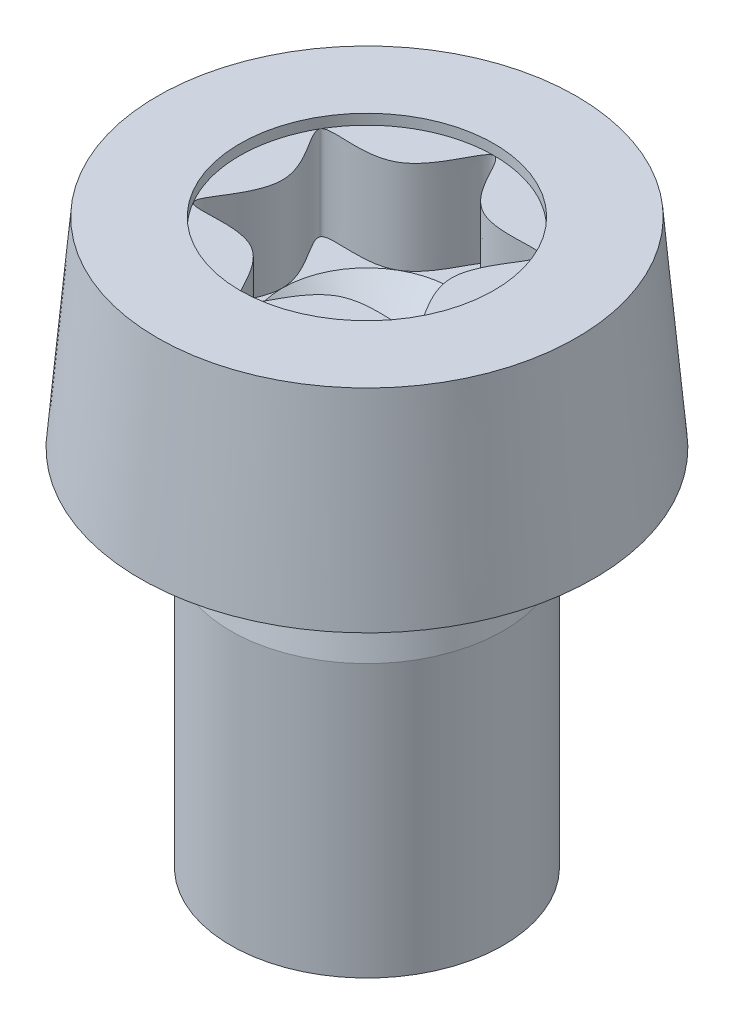
ISO-10303-21;
HEADER;
FILE_DESCRIPTION(('STEP AP214'),'2;1');
FILE_NAME('part.step','',(''),(''),'','','');
FILE_SCHEMA(('AUTOMOTIVE_DESIGN { 1 0 10303 214 1 1 1 1 }'));
ENDSEC;
DATA;
#1=APPLICATION_CONTEXT('core data for automotive mechanical design processes');
#2=APPLICATION_PROTOCOL_DEFINITION('international standard','automotive_design',2000,#1);
#3=PRODUCT_CONTEXT('',#1,'mechanical');
#4=PRODUCT('Part','Part','',(#3));
#5=PRODUCT_RELATED_PRODUCT_CATEGORY('part','',(#4));
#6=PRODUCT_DEFINITION_FORMATION('','',#4);
#7=PRODUCT_DEFINITION_CONTEXT('part definition',#1,'design');
#8=PRODUCT_DEFINITION('design','',#6,#7);
#9=PRODUCT_DEFINITION_SHAPE('','',#8);
#10=(LENGTH_UNIT() NAMED_UNIT(*) SI_UNIT(.MILLI.,.METRE.));
#11=(NAMED_UNIT(*) PLANE_ANGLE_UNIT() SI_UNIT($,.RADIAN.));
#12=(NAMED_UNIT(*) SI_UNIT($,.STERADIAN.) SOLID_ANGLE_UNIT());
#13=UNCERTAINTY_MEASURE_WITH_UNIT(LENGTH_MEASURE(1.E-05),#10,'distance_accuracy_value','');
#14=(GEOMETRIC_REPRESENTATION_CONTEXT(3) GLOBAL_UNCERTAINTY_ASSIGNED_CONTEXT((#13)) GLOBAL_UNIT_ASSIGNED_CONTEXT((#10,
#11,#12)) REPRESENTATION_CONTEXT('',''));
#15=CARTESIAN_POINT('',(0.,0.,0.));
#16=DIRECTION('',(0.,0.,1.));
#17=DIRECTION('',(1.,0.,0.));
#18=AXIS2_PLACEMENT_3D('',#15,#16,#17);
#19=CARTESIAN_POINT('',(0.,10.11,2.8));
#20=DIRECTION('',(0.,1.,0.));
#21=DIRECTION('',(0.,0.,1.));
#22=AXIS2_PLACEMENT_3D('',#19,#20,#21);
#23=PLANE('',#22);
#24=CARTESIAN_POINT('',(0.,10.11,-2.8));
#25=CARTESIAN_POINT('',(0.20130187734414,10.11,-2.8));
#26=CARTESIAN_POINT('',(0.603905632032412,10.11,-1.04599523765715));
#27=CARTESIAN_POINT('',(3.18437747187033,10.11,-1.83850119058572));
#28=CARTESIAN_POINT('',(1.20781126406484,10.11,0.));
#29=CARTESIAN_POINT('',(3.18437747187033,10.11,1.83850119058571));
#30=CARTESIAN_POINT('',(0.603905632032424,10.11,1.04599523765716));
#31=CARTESIAN_POINT('',(0.,10.11,3.67700238117141));
#32=CARTESIAN_POINT('',(-0.603905632032438,10.11,1.04599523765718));
#33=CARTESIAN_POINT('',(-3.18437747187032,10.11,1.83850119058571));
#34=CARTESIAN_POINT('',(-1.20781126406483,10.11,0.));
#35=CARTESIAN_POINT('',(-3.18437747187032,10.11,-1.83850119058571));
#36=CARTESIAN_POINT('',(-0.603905632032435,10.11,-1.04599523765716));
#37=CARTESIAN_POINT('',(-0.201301877344143,10.11,-2.80000000000001));
#38=CARTESIAN_POINT('',(0.,10.11,-2.8));
#39=B_SPLINE_CURVE_WITH_KNOTS('',3,(#24,#25,#26,#27,#28,#29,#30,#31,#32,#33,#34,#35,#36,#37,
#38),.UNSPECIFIED.,.T.,.F.,(4,1,1,1,1,1,1,1,1,1,1,1,4),(0.,0.0833333333333329,0.166666666666667,
0.25,0.333333333333334,0.416666666666668,0.5,0.583333333333333,0.666666666666667,0.75,
0.833333333333334,0.916666666666666,1.),.UNSPECIFIED.);
#40=CARTESIAN_POINT('',(0.933333333333329,10.11,-1.61658075373095));
#41=VERTEX_POINT('',#40);
#42=CARTESIAN_POINT('',(1.8666666666665,10.11,0.));
#43=VERTEX_POINT('',#42);
#44=EDGE_CURVE('E144',#41,#43,#39,.T.);
#45=ORIENTED_EDGE('',*,*,#44,.F.);
#46=CARTESIAN_POINT('',(0.,10.11,0.));
#47=DIRECTION('',(0.,-1.,0.));
#48=DIRECTION('',(0.,0.,-1.));
#49=AXIS2_PLACEMENT_3D('',#46,#47,#48);
#50=CIRCLE('',#49,1.8666666666665);
#51=EDGE_CURVE('E55',#41,#43,#50,.T.);
#52=ORIENTED_EDGE('',*,*,#51,.T.);
#53=EDGE_LOOP('',(#45,#52));
#54=FACE_BOUND('',#53,.T.);
#55=ADVANCED_FACE('F42',(#54),#23,.T.);
#56=CARTESIAN_POINT('',(0.933333333333247,10.11,1.61658075373081));
#57=VERTEX_POINT('',#56);
#58=EDGE_CURVE('E159',#43,#57,#39,.T.);
#59=ORIENTED_EDGE('',*,*,#58,.F.);
#60=EDGE_CURVE('E11',#43,#57,#50,.T.);
#61=ORIENTED_EDGE('',*,*,#60,.T.);
#62=EDGE_LOOP('',(#59,#61));
#63=FACE_BOUND('',#62,.T.);
#64=ADVANCED_FACE('F112',(#63),#23,.T.);
#65=CARTESIAN_POINT('',(-0.93333333333325,10.11,1.61658075373081));
#66=VERTEX_POINT('',#65);
#67=EDGE_CURVE('E152',#57,#66,#39,.T.);
#68=ORIENTED_EDGE('',*,*,#67,.F.);
#69=EDGE_CURVE('E53',#57,#66,#50,.T.);
#70=ORIENTED_EDGE('',*,*,#69,.T.);
#71=EDGE_LOOP('',(#68,#70));
#72=FACE_BOUND('',#71,.T.);
#73=ADVANCED_FACE('F119',(#72),#23,.T.);
#74=CARTESIAN_POINT('',(-1.8666666666665,10.11,0.));
#75=VERTEX_POINT('',#74);
#76=EDGE_CURVE('E150',#66,#75,#39,.T.);
#77=ORIENTED_EDGE('',*,*,#76,.F.);
#78=EDGE_CURVE('E437',#66,#75,#50,.T.);
#79=ORIENTED_EDGE('',*,*,#78,.T.);
#80=EDGE_LOOP('',(#77,#79));
#81=FACE_BOUND('',#80,.T.);
#82=ADVANCED_FACE('F133',(#81),#23,.T.);
#83=CARTESIAN_POINT('',(-0.933333333333257,10.11,-1.6165807537308));
#84=VERTEX_POINT('',#83);
#85=EDGE_CURVE('E141',#75,#84,#39,.T.);
#86=ORIENTED_EDGE('',*,*,#85,.F.);
#87=EDGE_CURVE('E214',#75,#84,#50,.T.);
#88=ORIENTED_EDGE('',*,*,#87,.T.);
#89=EDGE_LOOP('',(#86,#88));
#90=FACE_BOUND('',#89,.T.);
#91=ADVANCED_FACE('F125',(#90),#23,.T.);
#92=EDGE_CURVE('E137',#84,#41,#39,.T.);
#93=ORIENTED_EDGE('',*,*,#92,.F.);
#94=EDGE_CURVE('E139',#84,#41,#50,.T.);
#95=ORIENTED_EDGE('',*,*,#94,.T.);
#96=EDGE_LOOP('',(#93,#95));
#97=FACE_BOUND('',#96,.T.);
#98=ADVANCED_FACE('F115',(#97),#23,.T.);
#99=CARTESIAN_POINT('',(0.,12.4,0.));
#100=DIRECTION('',(0.,1.,0.));
#101=DIRECTION('',(0.,0.,1.));
#102=AXIS2_PLACEMENT_3D('',#99,#100,#101);
#103=PLANE('',#102);
#104=CARTESIAN_POINT('',(0.,12.4,0.));
#105=DIRECTION('',(0.,1.,0.));
#106=DIRECTION('',(0.,0.,1.));
#107=AXIS2_PLACEMENT_3D('',#104,#105,#106);
#108=CIRCLE('',#107,2.8);
#109=CARTESIAN_POINT('',(0.,12.4,2.8));
#110=VERTEX_POINT('',#109);
#111=EDGE_CURVE('E160',#110,#110,#108,.T.);
#112=ORIENTED_EDGE('',*,*,#111,.F.);
#113=EDGE_LOOP('',(#112));
#114=FACE_BOUND('',#113,.T.);
#115=CARTESIAN_POINT('',(0.,12.4,0.));
#116=DIRECTION('',(0.,-1.,0.));
#117=DIRECTION('',(0.,0.,-1.));
#118=AXIS2_PLACEMENT_3D('',#115,#116,#117);
#119=CIRCLE('',#118,4.61504988048596);
#120=CARTESIAN_POINT('',(0.,12.4,-4.61504988048596));
#121=VERTEX_POINT('',#120);
#122=EDGE_CURVE('E190',#121,#121,#119,.T.);
#123=ORIENTED_EDGE('',*,*,#122,.F.);
#124=EDGE_LOOP('',(#123));
#125=FACE_BOUND('',#124,.T.);
#126=ADVANCED_FACE('F124',(#114,#125),#103,.T.);
#127=CARTESIAN_POINT('',(0.,8.,0.));
#128=DIRECTION('',(0.,-1.,0.));
#129=DIRECTION('',(0.,0.,-1.));
#130=AXIS2_PLACEMENT_3D('',#127,#128,#129);
#131=CONICAL_SURFACE('',#130,5.,0.08726646259971);
#132=ORIENTED_EDGE('',*,*,#122,.T.);
#133=EDGE_LOOP('',(#132));
#134=FACE_BOUND('',#133,.T.);
#135=CARTESIAN_POINT('',(0.,8.,0.));
#136=DIRECTION('',(0.,-1.,0.));
#137=DIRECTION('',(0.,0.,-1.));
#138=AXIS2_PLACEMENT_3D('',#135,#136,#137);
#139=CIRCLE('',#138,5.);
#140=CARTESIAN_POINT('',(0.,8.,-5.));
#141=VERTEX_POINT('',#140);
#142=EDGE_CURVE('E193',#141,#141,#139,.T.);
#143=ORIENTED_EDGE('',*,*,#142,.F.);
#144=EDGE_LOOP('',(#143));
#145=FACE_BOUND('',#144,.T.);
#146=ADVANCED_FACE('F131',(#134,#145),#131,.T.);
#147=CARTESIAN_POINT('',(2.6,8.,0.));
#148=DIRECTION('',(0.,-1.,0.));
#149=DIRECTION('',(0.,0.,-1.));
#150=AXIS2_PLACEMENT_3D('',#147,#148,#149);
#151=PLANE('',#150);
#152=CARTESIAN_POINT('',(0.,8.,0.));
#153=DIRECTION('',(0.,-1.,0.));
#154=DIRECTION('',(0.,0.,-1.));
#155=AXIS2_PLACEMENT_3D('',#152,#153,#154);
#156=CIRCLE('',#155,2.90495097567964);
#157=CARTESIAN_POINT('',(0.,8.,-2.90495097567964));
#158=VERTEX_POINT('',#157);
#159=EDGE_CURVE('E202',#158,#158,#156,.F.);
#160=ORIENTED_EDGE('',*,*,#159,.T.);
#161=EDGE_LOOP('',(#160));
#162=FACE_BOUND('',#161,.T.);
#163=ORIENTED_EDGE('',*,*,#142,.T.);
#164=EDGE_LOOP('',(#163));
#165=FACE_BOUND('',#164,.T.);
#166=ADVANCED_FACE('F178',(#162,#165),#151,.T.);
#167=CARTESIAN_POINT('',(0.,6.,0.));
#168=DIRECTION('',(0.,-1.,0.));
#169=DIRECTION('',(0.,0.,-1.));
#170=AXIS2_PLACEMENT_3D('',#167,#168,#169);
#171=CONICAL_SURFACE('',#170,3.,0.197395559849881);
#172=CARTESIAN_POINT('',(0.,7.70097096621545,0.));
#173=DIRECTION('',(0.,-1.,0.));
#174=DIRECTION('',(0.,0.,-1.));
#175=AXIS2_PLACEMENT_3D('',#172,#173,#174);
#176=CIRCLE('',#175,2.65980580675691);
#177=CARTESIAN_POINT('',(0.,7.70097096621545,-2.65980580675691));
#178=VERTEX_POINT('',#177);
#179=EDGE_CURVE('E197',#178,#178,#176,.T.);
#180=ORIENTED_EDGE('',*,*,#179,.T.);
#181=EDGE_LOOP('',(#180));
#182=FACE_BOUND('',#181,.T.);
#183=CARTESIAN_POINT('',(0.,6.,0.));
#184=DIRECTION('',(0.,-1.,0.));
#185=DIRECTION('',(0.,0.,-1.));
#186=AXIS2_PLACEMENT_3D('',#183,#184,#185);
#187=CIRCLE('',#186,3.);
#188=CARTESIAN_POINT('',(0.,6.,-3.));
#189=VERTEX_POINT('',#188);
#190=EDGE_CURVE('E195',#189,#189,#187,.T.);
#191=ORIENTED_EDGE('',*,*,#190,.F.);
#192=EDGE_LOOP('',(#191));
#193=FACE_BOUND('',#192,.T.);
#194=ADVANCED_FACE('F174',(#182,#193),#171,.T.);
#195=CARTESIAN_POINT('',(0.,0.,0.));
#196=DIRECTION('',(0.,-1.,0.));
#197=DIRECTION('',(0.,0.,-1.));
#198=AXIS2_PLACEMENT_3D('',#195,#196,#197);
#199=CYLINDRICAL_SURFACE('',#198,3.);
#200=ORIENTED_EDGE('',*,*,#190,.T.);
#201=EDGE_LOOP('',(#200));
#202=FACE_BOUND('',#201,.T.);
#203=CARTESIAN_POINT('',(0.,0.,0.));
#204=DIRECTION('',(0.,-1.,0.));
#205=DIRECTION('',(0.,0.,-1.));
#206=AXIS2_PLACEMENT_3D('',#203,#204,#205);
#207=CIRCLE('',#206,3.);
#208=CARTESIAN_POINT('',(0.,0.,-3.));
#209=VERTEX_POINT('',#208);
#210=EDGE_CURVE('E158',#209,#209,#207,.T.);
#211=ORIENTED_EDGE('',*,*,#210,.F.);
#212=EDGE_LOOP('',(#211));
#213=FACE_BOUND('',#212,.T.);
#214=ADVANCED_FACE('F170',(#202,#213),#199,.T.);
#215=CARTESIAN_POINT('',(3.,0.,0.));
#216=DIRECTION('',(0.,-1.,0.));
#217=DIRECTION('',(0.,0.,-1.));
#218=AXIS2_PLACEMENT_3D('',#215,#216,#217);
#219=PLANE('',#218);
#220=ORIENTED_EDGE('',*,*,#210,.T.);
#221=EDGE_LOOP('',(#220));
#222=FACE_BOUND('',#221,.T.);
#223=ADVANCED_FACE('F167',(#222),#219,.T.);
#224=CARTESIAN_POINT('',(0.,7.75,0.));
#225=DIRECTION('',(0.,-1.,0.));
#226=DIRECTION('',(0.,0.,-1.));
#227=AXIS2_PLACEMENT_3D('',#224,#225,#226);
#228=TOROIDAL_SURFACE('',#227,2.90495097567964,0.25);
#229=ORIENTED_EDGE('',*,*,#159,.F.);
#230=EDGE_LOOP('',(#229));
#231=FACE_BOUND('',#230,.T.);
#232=ORIENTED_EDGE('',*,*,#179,.F.);
#233=EDGE_LOOP('',(#232));
#234=FACE_BOUND('',#233,.T.);
#235=ADVANCED_FACE('F44',(#231,#234),#228,.F.);
#236=CARTESIAN_POINT('',(0.,12.171,0.));
#237=DIRECTION('',(0.,1.,0.));
#238=DIRECTION('',(0.,0.,1.));
#239=AXIS2_PLACEMENT_3D('',#236,#237,#238);
#240=CYLINDRICAL_SURFACE('',#239,2.8);
#241=ORIENTED_EDGE('',*,*,#111,.T.);
#242=EDGE_LOOP('',(#241));
#243=FACE_BOUND('',#242,.T.);
#244=CARTESIAN_POINT('',(0.,12.171,0.));
#245=DIRECTION('',(0.,1.,0.));
#246=DIRECTION('',(0.,0.,1.));
#247=AXIS2_PLACEMENT_3D('',#244,#245,#246);
#248=CIRCLE('',#247,2.8);
#249=CARTESIAN_POINT('',(2.42487113059643,12.171,1.4));
#250=VERTEX_POINT('',#249);
#251=CARTESIAN_POINT('',(2.42487113059643,12.171,-1.4));
#252=VERTEX_POINT('',#251);
#253=EDGE_CURVE('E234',#250,#252,#248,.T.);
#254=ORIENTED_EDGE('',*,*,#253,.F.);
#255=CARTESIAN_POINT('',(0.,12.171,2.8));
#256=VERTEX_POINT('',#255);
#257=EDGE_CURVE('E142',#256,#250,#248,.T.);
#258=ORIENTED_EDGE('',*,*,#257,.F.);
#259=CARTESIAN_POINT('',(-2.42487113059643,12.171,1.4));
#260=VERTEX_POINT('',#259);
#261=EDGE_CURVE('E225',#260,#256,#248,.T.);
#262=ORIENTED_EDGE('',*,*,#261,.F.);
#263=CARTESIAN_POINT('',(-2.42487113059643,12.171,-1.4));
#264=VERTEX_POINT('',#263);
#265=EDGE_CURVE('E230',#264,#260,#248,.T.);
#266=ORIENTED_EDGE('',*,*,#265,.F.);
#267=CARTESIAN_POINT('',(0.,12.171,-2.8));
#268=VERTEX_POINT('',#267);
#269=EDGE_CURVE('E268',#268,#264,#248,.T.);
#270=ORIENTED_EDGE('',*,*,#269,.F.);
#271=EDGE_CURVE('E68',#252,#268,#248,.T.);
#272=ORIENTED_EDGE('',*,*,#271,.F.);
#273=EDGE_LOOP('',(#254,#258,#262,#266,#270,#272));
#274=FACE_BOUND('',#273,.T.);
#275=ADVANCED_FACE('F232',(#243,#274),#240,.F.);
#276=CARTESIAN_POINT('',(0.,12.171,0.));
#277=DIRECTION('',(0.,1.,0.));
#278=DIRECTION('',(0.,0.,1.));
#279=AXIS2_PLACEMENT_3D('',#276,#277,#278);
#280=PLANE('',#279);
#281=ORIENTED_EDGE('',*,*,#269,.T.);
#282=CARTESIAN_POINT('',(0.,12.171,-2.8));
#283=CARTESIAN_POINT('',(0.20130187734414,12.171,-2.8));
#284=CARTESIAN_POINT('',(0.603905632032412,12.171,-1.04599523765715));
#285=CARTESIAN_POINT('',(3.18437747187033,12.171,-1.83850119058572));
#286=CARTESIAN_POINT('',(1.20781126406484,12.171,0.));
#287=CARTESIAN_POINT('',(3.18437747187033,12.171,1.83850119058571));
#288=CARTESIAN_POINT('',(0.603905632032424,12.171,1.04599523765716));
#289=CARTESIAN_POINT('',(0.,12.171,3.67700238117141));
#290=CARTESIAN_POINT('',(-0.603905632032438,12.171,1.04599523765718));
#291=CARTESIAN_POINT('',(-3.18437747187032,12.171,1.83850119058571));
#292=CARTESIAN_POINT('',(-1.20781126406483,12.171,0.));
#293=CARTESIAN_POINT('',(-3.18437747187032,12.171,-1.83850119058571));
#294=CARTESIAN_POINT('',(-0.603905632032435,12.171,-1.04599523765716));
#295=CARTESIAN_POINT('',(-0.201301877344143,12.171,-2.80000000000001));
#296=CARTESIAN_POINT('',(0.,12.171,-2.8));
#297=B_SPLINE_CURVE_WITH_KNOTS('',3,(#282,#283,#284,#285,#286,#287,#288,#289,#290,#291,#292,
#293,#294,#295,#296),.UNSPECIFIED.,.T.,.F.,(4,1,1,1,1,1,1,1,1,1,1,1,4),(0.,0.0833333333333329,
0.166666666666667,0.25,0.333333333333334,0.416666666666668,0.5,0.583333333333333,
0.666666666666667,0.75,0.833333333333334,0.916666666666666,1.),.UNSPECIFIED.);
#298=EDGE_CURVE('E207',#268,#264,#297,.F.);
#299=ORIENTED_EDGE('',*,*,#298,.F.);
#300=EDGE_LOOP('',(#281,#299));
#301=FACE_BOUND('',#300,.T.);
#302=ADVANCED_FACE('F241',(#301),#280,.T.);
#303=ORIENTED_EDGE('',*,*,#265,.T.);
#304=EDGE_CURVE('E211',#264,#260,#297,.F.);
#305=ORIENTED_EDGE('',*,*,#304,.F.);
#306=EDGE_LOOP('',(#303,#305));
#307=FACE_BOUND('',#306,.T.);
#308=ADVANCED_FACE('F246',(#307),#280,.T.);
#309=ORIENTED_EDGE('',*,*,#261,.T.);
#310=EDGE_CURVE('E215',#260,#256,#297,.F.);
#311=ORIENTED_EDGE('',*,*,#310,.F.);
#312=EDGE_LOOP('',(#309,#311));
#313=FACE_BOUND('',#312,.T.);
#314=ADVANCED_FACE('F226',(#313),#280,.T.);
#315=ORIENTED_EDGE('',*,*,#257,.T.);
#316=EDGE_CURVE('E210',#256,#250,#297,.F.);
#317=ORIENTED_EDGE('',*,*,#316,.F.);
#318=EDGE_LOOP('',(#315,#317));
#319=FACE_BOUND('',#318,.T.);
#320=ADVANCED_FACE('F221',(#319),#280,.T.);
#321=ORIENTED_EDGE('',*,*,#253,.T.);
#322=EDGE_CURVE('E206',#250,#252,#297,.F.);
#323=ORIENTED_EDGE('',*,*,#322,.F.);
#324=EDGE_LOOP('',(#321,#323));
#325=FACE_BOUND('',#324,.T.);
#326=ADVANCED_FACE('F250',(#325),#280,.T.);
#327=ORIENTED_EDGE('',*,*,#271,.T.);
#328=EDGE_CURVE('E46',#252,#268,#297,.F.);
#329=ORIENTED_EDGE('',*,*,#328,.F.);
#330=EDGE_LOOP('',(#327,#329));
#331=FACE_BOUND('',#330,.T.);
#332=ADVANCED_FACE('F107',(#331),#280,.T.);
#333=DIRECTION('',(0.,1.,0.));
#334=VECTOR('',#333,1.);
#335=SURFACE_OF_LINEAR_EXTRUSION('',#39,#334);
#336=ORIENTED_EDGE('',*,*,#44,.T.);
#337=ORIENTED_EDGE('',*,*,#58,.T.);
#338=ORIENTED_EDGE('',*,*,#67,.T.);
#339=ORIENTED_EDGE('',*,*,#76,.T.);
#340=ORIENTED_EDGE('',*,*,#85,.T.);
#341=ORIENTED_EDGE('',*,*,#92,.T.);
#342=EDGE_LOOP('',(#336,#337,#338,#339,#340,#341));
#343=FACE_BOUND('',#342,.T.);
#344=ORIENTED_EDGE('',*,*,#328,.T.);
#345=ORIENTED_EDGE('',*,*,#298,.T.);
#346=ORIENTED_EDGE('',*,*,#304,.T.);
#347=ORIENTED_EDGE('',*,*,#310,.T.);
#348=ORIENTED_EDGE('',*,*,#316,.T.);
#349=ORIENTED_EDGE('',*,*,#322,.T.);
#350=EDGE_LOOP('',(#344,#345,#346,#347,#348,#349));
#351=FACE_BOUND('',#350,.T.);
#352=ADVANCED_FACE('F102',(#343,#351),#335,.T.);
#353=CARTESIAN_POINT('',(0.,8.44,0.));
#354=DIRECTION('',(0.,1.,0.));
#355=DIRECTION('',(0.,0.,1.));
#356=AXIS2_PLACEMENT_3D('',#353,#354,#355);
#357=CONICAL_SURFACE('',#356,0.,0.840948868883195);
#358=ORIENTED_EDGE('',*,*,#51,.F.);
#359=ORIENTED_EDGE('',*,*,#94,.F.);
#360=ORIENTED_EDGE('',*,*,#87,.F.);
#361=ORIENTED_EDGE('',*,*,#78,.F.);
#362=ORIENTED_EDGE('',*,*,#69,.F.);
#363=ORIENTED_EDGE('',*,*,#60,.F.);
#364=EDGE_LOOP('',(#358,#359,#360,#361,#362,#363));
#365=FACE_BOUND('',#364,.T.);
#366=CARTESIAN_POINT('',(0.,8.44,0.));
#367=VERTEX_POINT('',#366);
#368=VERTEX_LOOP('',#367);
#369=FACE_BOUND('',#368,.T.);
#370=ADVANCED_FACE('F100',(#365,#369),#357,.F.);
#371=CLOSED_SHELL('',(#55,#64,#73,#82,#91,#98,#126,#146,#166,#194,#214,#223,#235,#275,#302,#308,
#314,#320,#326,#332,#352,#370));
#372=MANIFOLD_SOLID_BREP('B2',#371);
#373=ADVANCED_BREP_SHAPE_REPRESENTATION('',(#18,#372),#14);
#374=SHAPE_DEFINITION_REPRESENTATION(#9,#373);
ENDSEC;
END-ISO-10303-21;
